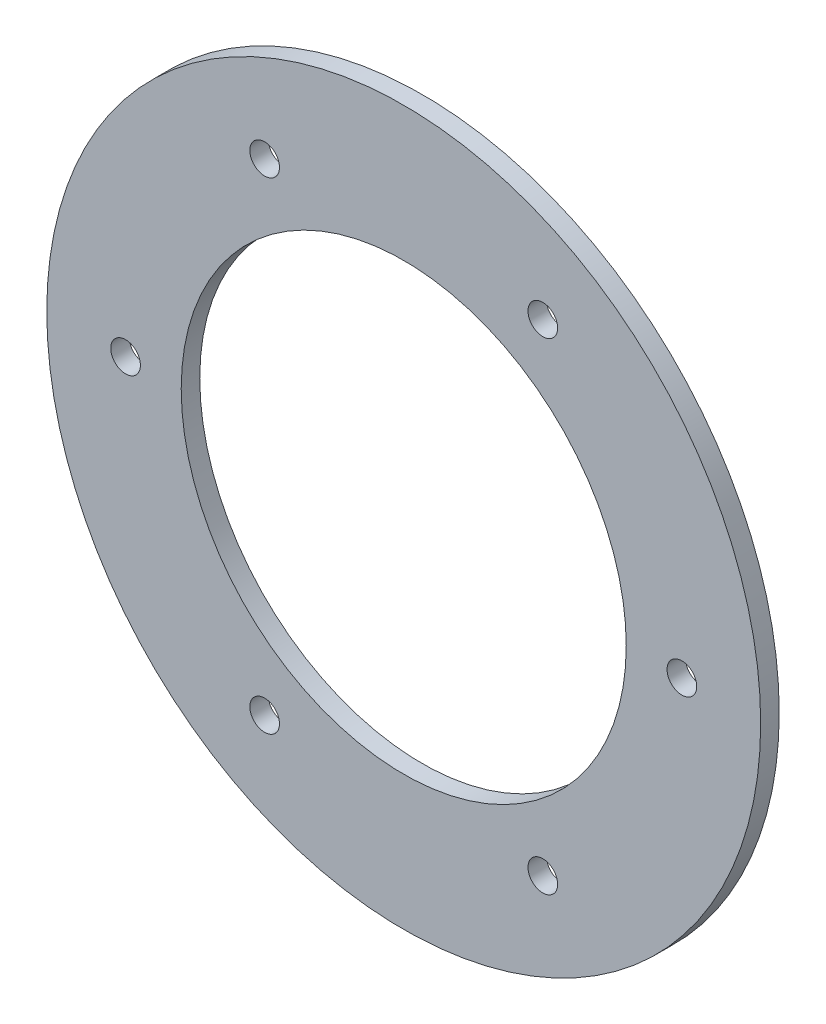
ISO-10303-21;
HEADER;
FILE_DESCRIPTION(('STEP AP214'),'2;1');
FILE_NAME('part.step','',(''),(''),'','','');
FILE_SCHEMA(('AUTOMOTIVE_DESIGN { 1 0 10303 214 1 1 1 1 }'));
ENDSEC;
DATA;
#1=APPLICATION_CONTEXT('core data for automotive mechanical design processes');
#2=APPLICATION_PROTOCOL_DEFINITION('international standard','automotive_design',2000,#1);
#3=PRODUCT_CONTEXT('',#1,'mechanical');
#4=PRODUCT('Part','Part','',(#3));
#5=PRODUCT_RELATED_PRODUCT_CATEGORY('part','',(#4));
#6=PRODUCT_DEFINITION_FORMATION('','',#4);
#7=PRODUCT_DEFINITION_CONTEXT('part definition',#1,'design');
#8=PRODUCT_DEFINITION('design','',#6,#7);
#9=PRODUCT_DEFINITION_SHAPE('','',#8);
#10=(LENGTH_UNIT() NAMED_UNIT(*) SI_UNIT(.MILLI.,.METRE.));
#11=(NAMED_UNIT(*) PLANE_ANGLE_UNIT() SI_UNIT($,.RADIAN.));
#12=(NAMED_UNIT(*) SI_UNIT($,.STERADIAN.) SOLID_ANGLE_UNIT());
#13=UNCERTAINTY_MEASURE_WITH_UNIT(LENGTH_MEASURE(1.E-05),#10,'distance_accuracy_value','');
#14=(GEOMETRIC_REPRESENTATION_CONTEXT(3) GLOBAL_UNCERTAINTY_ASSIGNED_CONTEXT((#13)) GLOBAL_UNIT_ASSIGNED_CONTEXT((#10,
#11,#12)) REPRESENTATION_CONTEXT('',''));
#15=CARTESIAN_POINT('',(0.,0.,0.));
#16=DIRECTION('',(0.,0.,1.));
#17=DIRECTION('',(1.,0.,0.));
#18=AXIS2_PLACEMENT_3D('',#15,#16,#17);
#19=CARTESIAN_POINT('',(0.,0.,2.));
#20=DIRECTION('',(0.,0.,1.));
#21=DIRECTION('',(1.,0.,0.));
#22=AXIS2_PLACEMENT_3D('',#19,#20,#21);
#23=PLANE('',#22);
#24=CARTESIAN_POINT('',(-14.9999999999948,25.9807621135329,2.));
#25=DIRECTION('',(0.,0.,1.));
#26=DIRECTION('',(1.,0.,0.));
#27=AXIS2_PLACEMENT_3D('',#24,#25,#26);
#28=CIRCLE('',#27,1.6);
#29=CARTESIAN_POINT('',(-13.3999999999948,25.9807621135329,2.));
#30=VERTEX_POINT('',#29);
#31=EDGE_CURVE('E70',#30,#30,#28,.T.);
#32=ORIENTED_EDGE('',*,*,#31,.F.);
#33=EDGE_LOOP('',(#32));
#34=FACE_BOUND('',#33,.T.);
#35=CARTESIAN_POINT('',(29.9999999999972,0.,2.));
#36=DIRECTION('',(0.,0.,1.));
#37=DIRECTION('',(1.,0.,0.));
#38=AXIS2_PLACEMENT_3D('',#35,#36,#37);
#39=CIRCLE('',#38,1.6);
#40=CARTESIAN_POINT('',(31.5999999999972,0.,2.));
#41=VERTEX_POINT('',#40);
#42=EDGE_CURVE('E58',#41,#41,#39,.T.);
#43=ORIENTED_EDGE('',*,*,#42,.F.);
#44=EDGE_LOOP('',(#43));
#45=FACE_BOUND('',#44,.T.);
#46=CARTESIAN_POINT('',(14.9999999999948,25.9807621135329,2.));
#47=DIRECTION('',(0.,0.,1.));
#48=DIRECTION('',(-1.,0.,0.));
#49=AXIS2_PLACEMENT_3D('',#46,#47,#48);
#50=CIRCLE('',#49,1.6);
#51=CARTESIAN_POINT('',(13.3999999999948,25.9807621135329,2.));
#52=VERTEX_POINT('',#51);
#53=EDGE_CURVE('E46',#52,#52,#50,.T.);
#54=ORIENTED_EDGE('',*,*,#53,.F.);
#55=EDGE_LOOP('',(#54));
#56=FACE_BOUND('',#55,.T.);
#57=CARTESIAN_POINT('',(0.,0.,2.));
#58=DIRECTION('',(0.,0.,1.));
#59=DIRECTION('',(1.,0.,0.));
#60=AXIS2_PLACEMENT_3D('',#57,#58,#59);
#61=CIRCLE('',#60,38.5);
#62=CARTESIAN_POINT('',(38.5,0.,2.));
#63=VERTEX_POINT('',#62);
#64=EDGE_CURVE('E10',#63,#63,#61,.T.);
#65=ORIENTED_EDGE('',*,*,#64,.T.);
#66=EDGE_LOOP('',(#65));
#67=FACE_BOUND('',#66,.T.);
#68=CARTESIAN_POINT('',(14.9999999999948,-25.9807621135329,2.));
#69=DIRECTION('',(0.,0.,1.));
#70=DIRECTION('',(-1.,0.,0.));
#71=AXIS2_PLACEMENT_3D('',#68,#69,#70);
#72=CIRCLE('',#71,1.6);
#73=CARTESIAN_POINT('',(13.3999999999948,-25.9807621135329,2.));
#74=VERTEX_POINT('',#73);
#75=EDGE_CURVE('E41',#74,#74,#72,.T.);
#76=ORIENTED_EDGE('',*,*,#75,.F.);
#77=EDGE_LOOP('',(#76));
#78=FACE_BOUND('',#77,.T.);
#79=CARTESIAN_POINT('',(-29.9999999999971,0.,2.));
#80=DIRECTION('',(0.,0.,1.));
#81=DIRECTION('',(1.,0.,0.));
#82=AXIS2_PLACEMENT_3D('',#79,#80,#81);
#83=CIRCLE('',#82,1.6);
#84=CARTESIAN_POINT('',(-28.3999999999971,0.,2.));
#85=VERTEX_POINT('',#84);
#86=EDGE_CURVE('E52',#85,#85,#83,.T.);
#87=ORIENTED_EDGE('',*,*,#86,.F.);
#88=EDGE_LOOP('',(#87));
#89=FACE_BOUND('',#88,.T.);
#90=CARTESIAN_POINT('',(-14.9999999999948,-25.9807621135329,2.));
#91=DIRECTION('',(0.,0.,1.));
#92=DIRECTION('',(1.,0.,0.));
#93=AXIS2_PLACEMENT_3D('',#90,#91,#92);
#94=CIRCLE('',#93,1.6);
#95=CARTESIAN_POINT('',(-13.3999999999948,-25.9807621135329,2.));
#96=VERTEX_POINT('',#95);
#97=EDGE_CURVE('E64',#96,#96,#94,.T.);
#98=ORIENTED_EDGE('',*,*,#97,.F.);
#99=EDGE_LOOP('',(#98));
#100=FACE_BOUND('',#99,.T.);
#101=CARTESIAN_POINT('',(0.,0.,2.));
#102=DIRECTION('',(0.,0.,1.));
#103=DIRECTION('',(1.,0.,0.));
#104=AXIS2_PLACEMENT_3D('',#101,#102,#103);
#105=CIRCLE('',#104,24.);
#106=CARTESIAN_POINT('',(24.,0.,2.));
#107=VERTEX_POINT('',#106);
#108=EDGE_CURVE('E76',#107,#107,#105,.T.);
#109=ORIENTED_EDGE('',*,*,#108,.F.);
#110=EDGE_LOOP('',(#109));
#111=FACE_BOUND('',#110,.T.);
#112=ADVANCED_FACE('F30',(#34,#45,#56,#67,#78,#89,#100,#111),#23,.T.);
#113=CARTESIAN_POINT('',(0.,0.,0.));
#114=DIRECTION('',(0.,0.,1.));
#115=DIRECTION('',(1.,0.,0.));
#116=AXIS2_PLACEMENT_3D('',#113,#114,#115);
#117=PLANE('',#116);
#118=CARTESIAN_POINT('',(-14.9999999999948,25.9807621135329,0.));
#119=DIRECTION('',(0.,0.,1.));
#120=DIRECTION('',(1.,0.,0.));
#121=AXIS2_PLACEMENT_3D('',#118,#119,#120);
#122=CIRCLE('',#121,1.6);
#123=CARTESIAN_POINT('',(-13.3999999999948,25.9807621135329,0.));
#124=VERTEX_POINT('',#123);
#125=EDGE_CURVE('E73',#124,#124,#122,.T.);
#126=ORIENTED_EDGE('',*,*,#125,.T.);
#127=EDGE_LOOP('',(#126));
#128=FACE_BOUND('',#127,.T.);
#129=CARTESIAN_POINT('',(29.9999999999972,0.,0.));
#130=DIRECTION('',(0.,0.,1.));
#131=DIRECTION('',(1.,0.,0.));
#132=AXIS2_PLACEMENT_3D('',#129,#130,#131);
#133=CIRCLE('',#132,1.6);
#134=CARTESIAN_POINT('',(31.5999999999972,0.,0.));
#135=VERTEX_POINT('',#134);
#136=EDGE_CURVE('E61',#135,#135,#133,.T.);
#137=ORIENTED_EDGE('',*,*,#136,.T.);
#138=EDGE_LOOP('',(#137));
#139=FACE_BOUND('',#138,.T.);
#140=CARTESIAN_POINT('',(14.9999999999948,25.9807621135329,0.));
#141=DIRECTION('',(0.,0.,1.));
#142=DIRECTION('',(-1.,0.,0.));
#143=AXIS2_PLACEMENT_3D('',#140,#141,#142);
#144=CIRCLE('',#143,1.6);
#145=CARTESIAN_POINT('',(13.3999999999948,25.9807621135329,0.));
#146=VERTEX_POINT('',#145);
#147=EDGE_CURVE('E49',#146,#146,#144,.T.);
#148=ORIENTED_EDGE('',*,*,#147,.T.);
#149=EDGE_LOOP('',(#148));
#150=FACE_BOUND('',#149,.T.);
#151=CARTESIAN_POINT('',(0.,0.,0.));
#152=DIRECTION('',(0.,0.,1.));
#153=DIRECTION('',(1.,0.,0.));
#154=AXIS2_PLACEMENT_3D('',#151,#152,#153);
#155=CIRCLE('',#154,38.5);
#156=CARTESIAN_POINT('',(38.5,0.,0.));
#157=VERTEX_POINT('',#156);
#158=EDGE_CURVE('E34',#157,#157,#155,.T.);
#159=ORIENTED_EDGE('',*,*,#158,.F.);
#160=EDGE_LOOP('',(#159));
#161=FACE_BOUND('',#160,.T.);
#162=CARTESIAN_POINT('',(14.9999999999948,-25.9807621135329,0.));
#163=DIRECTION('',(0.,0.,1.));
#164=DIRECTION('',(-1.,0.,0.));
#165=AXIS2_PLACEMENT_3D('',#162,#163,#164);
#166=CIRCLE('',#165,1.6);
#167=CARTESIAN_POINT('',(13.3999999999948,-25.9807621135329,0.));
#168=VERTEX_POINT('',#167);
#169=EDGE_CURVE('E43',#168,#168,#166,.T.);
#170=ORIENTED_EDGE('',*,*,#169,.T.);
#171=EDGE_LOOP('',(#170));
#172=FACE_BOUND('',#171,.T.);
#173=CARTESIAN_POINT('',(-29.9999999999971,0.,0.));
#174=DIRECTION('',(0.,0.,1.));
#175=DIRECTION('',(1.,0.,0.));
#176=AXIS2_PLACEMENT_3D('',#173,#174,#175);
#177=CIRCLE('',#176,1.6);
#178=CARTESIAN_POINT('',(-28.3999999999971,0.,0.));
#179=VERTEX_POINT('',#178);
#180=EDGE_CURVE('E55',#179,#179,#177,.T.);
#181=ORIENTED_EDGE('',*,*,#180,.T.);
#182=EDGE_LOOP('',(#181));
#183=FACE_BOUND('',#182,.T.);
#184=CARTESIAN_POINT('',(-14.9999999999948,-25.9807621135329,0.));
#185=DIRECTION('',(0.,0.,1.));
#186=DIRECTION('',(1.,0.,0.));
#187=AXIS2_PLACEMENT_3D('',#184,#185,#186);
#188=CIRCLE('',#187,1.6);
#189=CARTESIAN_POINT('',(-13.3999999999948,-25.9807621135329,0.));
#190=VERTEX_POINT('',#189);
#191=EDGE_CURVE('E67',#190,#190,#188,.T.);
#192=ORIENTED_EDGE('',*,*,#191,.T.);
#193=EDGE_LOOP('',(#192));
#194=FACE_BOUND('',#193,.T.);
#195=CARTESIAN_POINT('',(0.,0.,0.));
#196=DIRECTION('',(0.,0.,1.));
#197=DIRECTION('',(1.,0.,0.));
#198=AXIS2_PLACEMENT_3D('',#195,#196,#197);
#199=CIRCLE('',#198,24.);
#200=CARTESIAN_POINT('',(24.,0.,0.));
#201=VERTEX_POINT('',#200);
#202=EDGE_CURVE('E79',#201,#201,#199,.T.);
#203=ORIENTED_EDGE('',*,*,#202,.T.);
#204=EDGE_LOOP('',(#203));
#205=FACE_BOUND('',#204,.T.);
#206=ADVANCED_FACE('F89',(#128,#139,#150,#161,#172,#183,#194,#205),#117,.F.);
#207=CARTESIAN_POINT('',(0.,0.,2.));
#208=DIRECTION('',(0.,0.,-1.));
#209=DIRECTION('',(-1.,0.,0.));
#210=AXIS2_PLACEMENT_3D('',#207,#208,#209);
#211=CYLINDRICAL_SURFACE('',#210,38.5);
#212=ORIENTED_EDGE('',*,*,#64,.F.);
#213=EDGE_LOOP('',(#212));
#214=FACE_BOUND('',#213,.T.);
#215=ORIENTED_EDGE('',*,*,#158,.T.);
#216=EDGE_LOOP('',(#215));
#217=FACE_BOUND('',#216,.T.);
#218=ADVANCED_FACE('F32',(#214,#217),#211,.T.);
#219=CARTESIAN_POINT('',(14.9999999999948,-25.9807621135329,2.));
#220=DIRECTION('',(0.,0.,-1.));
#221=DIRECTION('',(-1.,0.,0.));
#222=AXIS2_PLACEMENT_3D('',#219,#220,#221);
#223=CYLINDRICAL_SURFACE('',#222,1.6);
#224=ORIENTED_EDGE('',*,*,#75,.T.);
#225=EDGE_LOOP('',(#224));
#226=FACE_BOUND('',#225,.T.);
#227=ORIENTED_EDGE('',*,*,#169,.F.);
#228=EDGE_LOOP('',(#227));
#229=FACE_BOUND('',#228,.T.);
#230=ADVANCED_FACE('F99',(#226,#229),#223,.F.);
#231=CARTESIAN_POINT('',(14.9999999999948,25.9807621135329,2.));
#232=DIRECTION('',(0.,0.,-1.));
#233=DIRECTION('',(-1.,0.,0.));
#234=AXIS2_PLACEMENT_3D('',#231,#232,#233);
#235=CYLINDRICAL_SURFACE('',#234,1.6);
#236=ORIENTED_EDGE('',*,*,#53,.T.);
#237=EDGE_LOOP('',(#236));
#238=FACE_BOUND('',#237,.T.);
#239=ORIENTED_EDGE('',*,*,#147,.F.);
#240=EDGE_LOOP('',(#239));
#241=FACE_BOUND('',#240,.T.);
#242=ADVANCED_FACE('F102',(#238,#241),#235,.F.);
#243=CARTESIAN_POINT('',(-29.9999999999971,0.,2.));
#244=DIRECTION('',(0.,0.,-1.));
#245=DIRECTION('',(-1.,0.,0.));
#246=AXIS2_PLACEMENT_3D('',#243,#244,#245);
#247=CYLINDRICAL_SURFACE('',#246,1.6);
#248=ORIENTED_EDGE('',*,*,#86,.T.);
#249=EDGE_LOOP('',(#248));
#250=FACE_BOUND('',#249,.T.);
#251=ORIENTED_EDGE('',*,*,#180,.F.);
#252=EDGE_LOOP('',(#251));
#253=FACE_BOUND('',#252,.T.);
#254=ADVANCED_FACE('F106',(#250,#253),#247,.F.);
#255=CARTESIAN_POINT('',(29.9999999999972,0.,2.));
#256=DIRECTION('',(0.,0.,-1.));
#257=DIRECTION('',(-1.,0.,0.));
#258=AXIS2_PLACEMENT_3D('',#255,#256,#257);
#259=CYLINDRICAL_SURFACE('',#258,1.6);
#260=ORIENTED_EDGE('',*,*,#42,.T.);
#261=EDGE_LOOP('',(#260));
#262=FACE_BOUND('',#261,.T.);
#263=ORIENTED_EDGE('',*,*,#136,.F.);
#264=EDGE_LOOP('',(#263));
#265=FACE_BOUND('',#264,.T.);
#266=ADVANCED_FACE('F110',(#262,#265),#259,.F.);
#267=CARTESIAN_POINT('',(-14.9999999999948,-25.9807621135329,2.));
#268=DIRECTION('',(0.,0.,-1.));
#269=DIRECTION('',(-1.,0.,0.));
#270=AXIS2_PLACEMENT_3D('',#267,#268,#269);
#271=CYLINDRICAL_SURFACE('',#270,1.6);
#272=ORIENTED_EDGE('',*,*,#97,.T.);
#273=EDGE_LOOP('',(#272));
#274=FACE_BOUND('',#273,.T.);
#275=ORIENTED_EDGE('',*,*,#191,.F.);
#276=EDGE_LOOP('',(#275));
#277=FACE_BOUND('',#276,.T.);
#278=ADVANCED_FACE('F114',(#274,#277),#271,.F.);
#279=CARTESIAN_POINT('',(-14.9999999999948,25.9807621135329,2.));
#280=DIRECTION('',(0.,0.,-1.));
#281=DIRECTION('',(-1.,0.,0.));
#282=AXIS2_PLACEMENT_3D('',#279,#280,#281);
#283=CYLINDRICAL_SURFACE('',#282,1.6);
#284=ORIENTED_EDGE('',*,*,#31,.T.);
#285=EDGE_LOOP('',(#284));
#286=FACE_BOUND('',#285,.T.);
#287=ORIENTED_EDGE('',*,*,#125,.F.);
#288=EDGE_LOOP('',(#287));
#289=FACE_BOUND('',#288,.T.);
#290=ADVANCED_FACE('F118',(#286,#289),#283,.F.);
#291=CARTESIAN_POINT('',(0.,0.,2.));
#292=DIRECTION('',(0.,0.,-1.));
#293=DIRECTION('',(-1.,0.,0.));
#294=AXIS2_PLACEMENT_3D('',#291,#292,#293);
#295=CYLINDRICAL_SURFACE('',#294,24.);
#296=ORIENTED_EDGE('',*,*,#108,.T.);
#297=EDGE_LOOP('',(#296));
#298=FACE_BOUND('',#297,.T.);
#299=ORIENTED_EDGE('',*,*,#202,.F.);
#300=EDGE_LOOP('',(#299));
#301=FACE_BOUND('',#300,.T.);
#302=ADVANCED_FACE('F85',(#298,#301),#295,.F.);
#303=CLOSED_SHELL('',(#112,#206,#218,#230,#242,#254,#266,#278,#290,#302));
#304=MANIFOLD_SOLID_BREP('B2',#303);
#305=ADVANCED_BREP_SHAPE_REPRESENTATION('',(#18,#304),#14);
#306=SHAPE_DEFINITION_REPRESENTATION(#9,#305);
ENDSEC;
END-ISO-10303-21;
